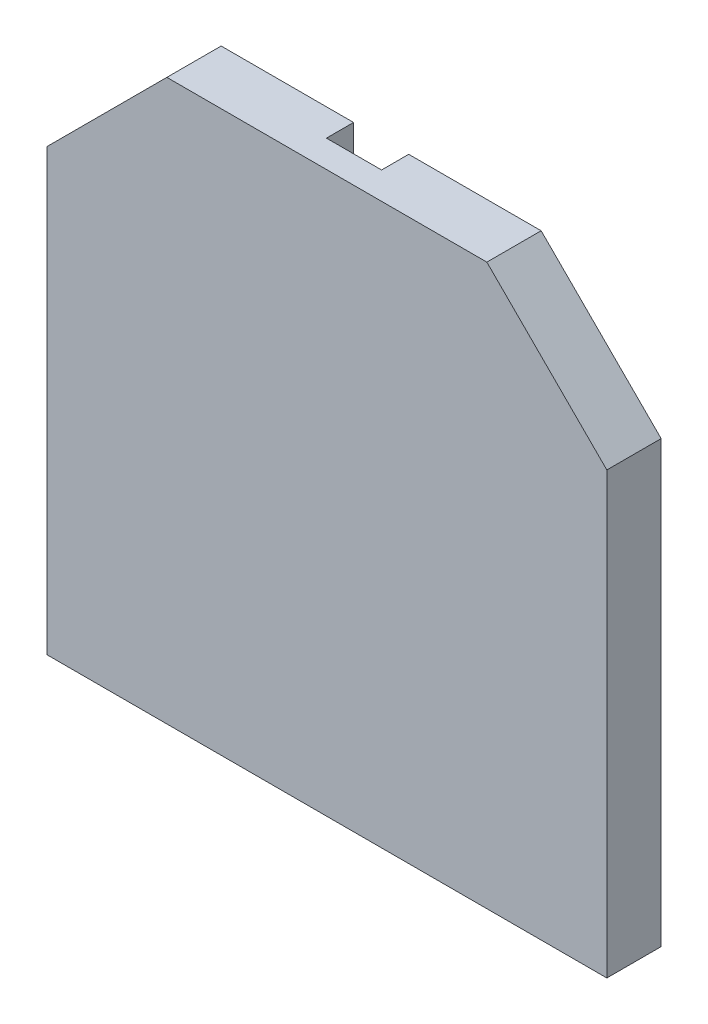
ISO-10303-21;
HEADER;
FILE_DESCRIPTION(('STEP AP214'),'2;1');
FILE_NAME('part.step','',(''),(''),'','','');
FILE_SCHEMA(('AUTOMOTIVE_DESIGN { 1 0 10303 214 1 1 1 1 }'));
ENDSEC;
DATA;
#1=APPLICATION_CONTEXT('core data for automotive mechanical design processes');
#2=APPLICATION_PROTOCOL_DEFINITION('international standard','automotive_design',2000,#1);
#3=PRODUCT_CONTEXT('',#1,'mechanical');
#4=PRODUCT('Part','Part','',(#3));
#5=PRODUCT_RELATED_PRODUCT_CATEGORY('part','',(#4));
#6=PRODUCT_DEFINITION_FORMATION('','',#4);
#7=PRODUCT_DEFINITION_CONTEXT('part definition',#1,'design');
#8=PRODUCT_DEFINITION('design','',#6,#7);
#9=PRODUCT_DEFINITION_SHAPE('','',#8);
#10=(LENGTH_UNIT() NAMED_UNIT(*) SI_UNIT(.MILLI.,.METRE.));
#11=(NAMED_UNIT(*) PLANE_ANGLE_UNIT() SI_UNIT($,.RADIAN.));
#12=(NAMED_UNIT(*) SI_UNIT($,.STERADIAN.) SOLID_ANGLE_UNIT());
#13=UNCERTAINTY_MEASURE_WITH_UNIT(LENGTH_MEASURE(1.E-05),#10,'distance_accuracy_value','');
#14=(GEOMETRIC_REPRESENTATION_CONTEXT(3) GLOBAL_UNCERTAINTY_ASSIGNED_CONTEXT((#13)) GLOBAL_UNIT_ASSIGNED_CONTEXT((#10,
#11,#12)) REPRESENTATION_CONTEXT('',''));
#15=CARTESIAN_POINT('',(0.,0.,0.));
#16=DIRECTION('',(0.,0.,1.));
#17=DIRECTION('',(1.,0.,0.));
#18=AXIS2_PLACEMENT_3D('',#15,#16,#17);
#19=CARTESIAN_POINT('',(-0.32500316,0.68579492,0.31999936));
#20=DIRECTION('',(0.,0.,-1.));
#21=DIRECTION('',(-1.,0.,0.));
#22=AXIS2_PLACEMENT_3D('',#19,#20,#21);
#23=PLANE('',#22);
#24=DIRECTION('',(-1.,0.,0.));
#25=VECTOR('',#24,1.);
#26=CARTESIAN_POINT('',(-0.32500316,0.48579532,0.31999936));
#27=LINE('',#26,#25);
#28=CARTESIAN_POINT('',(-0.32500316,0.48579532,0.31999936));
#29=VERTEX_POINT('',#28);
#30=CARTESIAN_POINT('',(0.32499808,0.48579532,0.31999936));
#31=VERTEX_POINT('',#30);
#32=EDGE_CURVE('E19',#29,#31,#27,.F.);
#33=ORIENTED_EDGE('',*,*,#32,.T.);
#34=DIRECTION('',(0.,1.,0.));
#35=VECTOR('',#34,1.);
#36=CARTESIAN_POINT('',(0.32499808,-1.91420496,0.31999936));
#37=LINE('',#36,#35);
#38=CARTESIAN_POINT('',(0.32499808,-1.91420496,0.31999936));
#39=VERTEX_POINT('',#38);
#40=EDGE_CURVE('E114',#39,#31,#37,.T.);
#41=ORIENTED_EDGE('',*,*,#40,.F.);
#42=DIRECTION('',(1.,0.,0.));
#43=VECTOR('',#42,1.);
#44=CARTESIAN_POINT('',(-0.32500316,-1.91420496,0.31999936));
#45=LINE('',#44,#43);
#46=CARTESIAN_POINT('',(-0.32500316,-1.91420496,0.31999936));
#47=VERTEX_POINT('',#46);
#48=EDGE_CURVE('E131',#47,#39,#45,.T.);
#49=ORIENTED_EDGE('',*,*,#48,.F.);
#50=DIRECTION('',(0.,1.,0.));
#51=VECTOR('',#50,1.);
#52=CARTESIAN_POINT('',(-0.32500316,0.68579492,0.31999936));
#53=LINE('',#52,#51);
#54=EDGE_CURVE('E119',#29,#47,#53,.F.);
#55=ORIENTED_EDGE('',*,*,#54,.F.);
#56=EDGE_LOOP('',(#33,#41,#49,#55));
#57=FACE_BOUND('',#56,.T.);
#58=ADVANCED_FACE('F16',(#57),#23,.T.);
#59=CARTESIAN_POINT('',(-0.32500316,-3.71420136,0.31999936));
#60=DIRECTION('',(0.,0.,-1.));
#61=DIRECTION('',(-1.,0.,0.));
#62=AXIS2_PLACEMENT_3D('',#59,#60,#61);
#63=PLANE('',#62);
#64=DIRECTION('',(-1.,0.,0.));
#65=VECTOR('',#64,1.);
#66=CARTESIAN_POINT('',(-0.32500316,-6.11420164,0.31999936));
#67=LINE('',#66,#65);
#68=CARTESIAN_POINT('',(0.32499808,-6.11420164,0.31999936));
#69=VERTEX_POINT('',#68);
#70=CARTESIAN_POINT('',(-0.32500316,-6.11420164,0.31999936));
#71=VERTEX_POINT('',#70);
#72=EDGE_CURVE('E122',#69,#71,#67,.T.);
#73=ORIENTED_EDGE('',*,*,#72,.T.);
#74=DIRECTION('',(0.,1.,0.));
#75=VECTOR('',#74,1.);
#76=CARTESIAN_POINT('',(-0.32500316,-3.71420136,0.31999936));
#77=LINE('',#76,#75);
#78=CARTESIAN_POINT('',(-0.32500316,-3.71420136,0.31999936));
#79=VERTEX_POINT('',#78);
#80=EDGE_CURVE('E147',#79,#71,#77,.F.);
#81=ORIENTED_EDGE('',*,*,#80,.F.);
#82=DIRECTION('',(1.,0.,0.));
#83=VECTOR('',#82,1.);
#84=CARTESIAN_POINT('',(0.32499808,-3.71420136,0.31999936));
#85=LINE('',#84,#83);
#86=CARTESIAN_POINT('',(0.32499808,-3.71420136,0.31999936));
#87=VERTEX_POINT('',#86);
#88=EDGE_CURVE('E152',#87,#79,#85,.F.);
#89=ORIENTED_EDGE('',*,*,#88,.F.);
#90=DIRECTION('',(0.,1.,0.));
#91=VECTOR('',#90,1.);
#92=CARTESIAN_POINT('',(0.32499808,-6.31420124,0.31999936));
#93=LINE('',#92,#91);
#94=EDGE_CURVE('E164',#69,#87,#93,.T.);
#95=ORIENTED_EDGE('',*,*,#94,.F.);
#96=EDGE_LOOP('',(#73,#81,#89,#95));
#97=FACE_BOUND('',#96,.T.);
#98=ADVANCED_FACE('F250',(#97),#63,.T.);
#99=CARTESIAN_POINT('',(0.32499808,-1.91420496,-1.00000054));
#100=DIRECTION('',(-1.,0.,0.));
#101=DIRECTION('',(0.,0.,1.));
#102=AXIS2_PLACEMENT_3D('',#99,#100,#101);
#103=PLANE('',#102);
#104=DIRECTION('',(0.,0.,1.));
#105=VECTOR('',#104,1.);
#106=CARTESIAN_POINT('',(0.32499808,0.48579532,-1.00000054));
#107=LINE('',#106,#105);
#108=CARTESIAN_POINT('',(0.32499808,0.48579532,0.));
#109=VERTEX_POINT('',#108);
#110=EDGE_CURVE('E124',#31,#109,#107,.F.);
#111=ORIENTED_EDGE('',*,*,#110,.T.);
#112=DIRECTION('',(0.,1.,0.));
#113=VECTOR('',#112,1.);
#114=CARTESIAN_POINT('',(0.32499808,0.48579532,0.));
#115=LINE('',#114,#113);
#116=CARTESIAN_POINT('',(0.32499808,-1.91420496,0.));
#117=VERTEX_POINT('',#116);
#118=EDGE_CURVE('E167',#109,#117,#115,.F.);
#119=ORIENTED_EDGE('',*,*,#118,.T.);
#120=DIRECTION('',(0.,0.,1.));
#121=VECTOR('',#120,1.);
#122=CARTESIAN_POINT('',(0.32499808,-1.91420496,-1.00000054));
#123=LINE('',#122,#121);
#124=EDGE_CURVE('E135',#39,#117,#123,.F.);
#125=ORIENTED_EDGE('',*,*,#124,.F.);
#126=ORIENTED_EDGE('',*,*,#40,.T.);
#127=EDGE_LOOP('',(#111,#119,#125,#126));
#128=FACE_BOUND('',#127,.T.);
#129=ADVANCED_FACE('F133',(#128),#103,.T.);
#130=CARTESIAN_POINT('',(-0.32500316,-1.91420496,-1.00000054));
#131=DIRECTION('',(0.,1.,0.));
#132=DIRECTION('',(0.,0.,1.));
#133=AXIS2_PLACEMENT_3D('',#130,#131,#132);
#134=PLANE('',#133);
#135=ORIENTED_EDGE('',*,*,#124,.T.);
#136=DIRECTION('',(1.,0.,0.));
#137=VECTOR('',#136,1.);
#138=CARTESIAN_POINT('',(-1.88578998,-1.91420496,0.));
#139=LINE('',#138,#137);
#140=CARTESIAN_POINT('',(-0.32500316,-1.91420496,0.));
#141=VERTEX_POINT('',#140);
#142=EDGE_CURVE('E169',#117,#141,#139,.F.);
#143=ORIENTED_EDGE('',*,*,#142,.T.);
#144=DIRECTION('',(0.,0.,-1.));
#145=VECTOR('',#144,1.);
#146=CARTESIAN_POINT('',(-0.32500316,-1.91420496,-1.00000054));
#147=LINE('',#146,#145);
#148=EDGE_CURVE('E141',#47,#141,#147,.T.);
#149=ORIENTED_EDGE('',*,*,#148,.F.);
#150=ORIENTED_EDGE('',*,*,#48,.T.);
#151=EDGE_LOOP('',(#135,#143,#149,#150));
#152=FACE_BOUND('',#151,.T.);
#153=ADVANCED_FACE('F270',(#152),#134,.T.);
#154=CARTESIAN_POINT('',(-0.32500316,0.68579492,-1.00000054));
#155=DIRECTION('',(1.,0.,0.));
#156=DIRECTION('',(0.,0.,-1.));
#157=AXIS2_PLACEMENT_3D('',#154,#155,#156);
#158=PLANE('',#157);
#159=DIRECTION('',(0.,0.,-1.));
#160=VECTOR('',#159,1.);
#161=CARTESIAN_POINT('',(-0.32500316,0.48579532,-1.00000054));
#162=LINE('',#161,#160);
#163=CARTESIAN_POINT('',(-0.32500316,0.48579532,0.));
#164=VERTEX_POINT('',#163);
#165=EDGE_CURVE('E144',#164,#29,#162,.F.);
#166=ORIENTED_EDGE('',*,*,#165,.T.);
#167=ORIENTED_EDGE('',*,*,#54,.T.);
#168=ORIENTED_EDGE('',*,*,#148,.T.);
#169=DIRECTION('',(0.,1.,0.));
#170=VECTOR('',#169,1.);
#171=CARTESIAN_POINT('',(-0.32500316,0.48579532,0.));
#172=LINE('',#171,#170);
#173=EDGE_CURVE('E171',#141,#164,#172,.T.);
#174=ORIENTED_EDGE('',*,*,#173,.T.);
#175=EDGE_LOOP('',(#166,#167,#168,#174));
#176=FACE_BOUND('',#175,.T.);
#177=ADVANCED_FACE('F267',(#176),#158,.T.);
#178=CARTESIAN_POINT('',(-0.32500316,-3.71420136,-1.00000054));
#179=DIRECTION('',(1.,0.,0.));
#180=DIRECTION('',(0.,0.,-1.));
#181=AXIS2_PLACEMENT_3D('',#178,#179,#180);
#182=PLANE('',#181);
#183=DIRECTION('',(0.,0.,-1.));
#184=VECTOR('',#183,1.);
#185=CARTESIAN_POINT('',(-0.32500316,-6.11420164,-1.00000054));
#186=LINE('',#185,#184);
#187=CARTESIAN_POINT('',(-0.32500316,-6.11420164,0.));
#188=VERTEX_POINT('',#187);
#189=EDGE_CURVE('E150',#71,#188,#186,.T.);
#190=ORIENTED_EDGE('',*,*,#189,.T.);
#191=DIRECTION('',(0.,1.,0.));
#192=VECTOR('',#191,1.);
#193=CARTESIAN_POINT('',(-0.32500316,0.48579532,0.));
#194=LINE('',#193,#192);
#195=CARTESIAN_POINT('',(-0.32500316,-3.71420136,0.));
#196=VERTEX_POINT('',#195);
#197=EDGE_CURVE('E174',#188,#196,#194,.T.);
#198=ORIENTED_EDGE('',*,*,#197,.T.);
#199=DIRECTION('',(0.,0.,-1.));
#200=VECTOR('',#199,1.);
#201=CARTESIAN_POINT('',(-0.32500316,-3.71420136,-1.00000054));
#202=LINE('',#201,#200);
#203=EDGE_CURVE('E155',#79,#196,#202,.T.);
#204=ORIENTED_EDGE('',*,*,#203,.F.);
#205=ORIENTED_EDGE('',*,*,#80,.T.);
#206=EDGE_LOOP('',(#190,#198,#204,#205));
#207=FACE_BOUND('',#206,.T.);
#208=ADVANCED_FACE('F244',(#207),#182,.T.);
#209=CARTESIAN_POINT('',(0.32499808,-3.71420136,-1.00000054));
#210=DIRECTION('',(0.,-1.,0.));
#211=DIRECTION('',(0.,0.,-1.));
#212=AXIS2_PLACEMENT_3D('',#209,#210,#211);
#213=PLANE('',#212);
#214=ORIENTED_EDGE('',*,*,#203,.T.);
#215=DIRECTION('',(1.,0.,0.));
#216=VECTOR('',#215,1.);
#217=CARTESIAN_POINT('',(-1.88578998,-3.71420136,0.));
#218=LINE('',#217,#216);
#219=CARTESIAN_POINT('',(0.32499808,-3.71420136,0.));
#220=VERTEX_POINT('',#219);
#221=EDGE_CURVE('E176',#196,#220,#218,.T.);
#222=ORIENTED_EDGE('',*,*,#221,.T.);
#223=DIRECTION('',(0.,0.,1.));
#224=VECTOR('',#223,1.);
#225=CARTESIAN_POINT('',(0.32499808,-3.71420136,-1.00000054));
#226=LINE('',#225,#224);
#227=EDGE_CURVE('E158',#87,#220,#226,.F.);
#228=ORIENTED_EDGE('',*,*,#227,.F.);
#229=ORIENTED_EDGE('',*,*,#88,.T.);
#230=EDGE_LOOP('',(#214,#222,#228,#229));
#231=FACE_BOUND('',#230,.T.);
#232=ADVANCED_FACE('F246',(#231),#213,.T.);
#233=CARTESIAN_POINT('',(0.32499808,-6.31420124,-1.00000054));
#234=DIRECTION('',(-1.,0.,0.));
#235=DIRECTION('',(0.,0.,1.));
#236=AXIS2_PLACEMENT_3D('',#233,#234,#235);
#237=PLANE('',#236);
#238=DIRECTION('',(0.,0.,1.));
#239=VECTOR('',#238,1.);
#240=CARTESIAN_POINT('',(0.32499808,-6.11420164,-1.00000054));
#241=LINE('',#240,#239);
#242=CARTESIAN_POINT('',(0.32499808,-6.11420164,0.));
#243=VERTEX_POINT('',#242);
#244=EDGE_CURVE('E161',#243,#69,#241,.T.);
#245=ORIENTED_EDGE('',*,*,#244,.T.);
#246=ORIENTED_EDGE('',*,*,#94,.T.);
#247=ORIENTED_EDGE('',*,*,#227,.T.);
#248=DIRECTION('',(0.,1.,0.));
#249=VECTOR('',#248,1.);
#250=CARTESIAN_POINT('',(0.32499808,0.48579532,0.));
#251=LINE('',#250,#249);
#252=EDGE_CURVE('E178',#220,#243,#251,.F.);
#253=ORIENTED_EDGE('',*,*,#252,.T.);
#254=EDGE_LOOP('',(#245,#246,#247,#253));
#255=FACE_BOUND('',#254,.T.);
#256=ADVANCED_FACE('F254',(#255),#237,.T.);
#257=CARTESIAN_POINT('',(-1.88578998,0.48579532,0.));
#258=DIRECTION('',(0.,0.,1.));
#259=DIRECTION('',(1.,0.,0.));
#260=AXIS2_PLACEMENT_3D('',#257,#258,#259);
#261=PLANE('',#260);
#262=DIRECTION('',(-0.707106781186548,0.707106781186548,0.));
#263=VECTOR('',#262,1.);
#264=CARTESIAN_POINT('',(1.8857849,0.48579532,0.));
#265=LINE('',#264,#263);
#266=CARTESIAN_POINT('',(3.29999848,-0.92841826,0.));
#267=VERTEX_POINT('',#266);
#268=CARTESIAN_POINT('',(1.8857849,0.48579532,0.));
#269=VERTEX_POINT('',#268);
#270=EDGE_CURVE('E181',#267,#269,#265,.T.);
#271=ORIENTED_EDGE('',*,*,#270,.F.);
#272=DIRECTION('',(0.,1.,0.));
#273=VECTOR('',#272,1.);
#274=CARTESIAN_POINT('',(3.29999848,-0.92841826,0.));
#275=LINE('',#274,#273);
#276=CARTESIAN_POINT('',(3.29999848,-6.11420164,0.));
#277=VERTEX_POINT('',#276);
#278=EDGE_CURVE('E208',#277,#267,#275,.T.);
#279=ORIENTED_EDGE('',*,*,#278,.F.);
#280=DIRECTION('',(1.,0.,0.));
#281=VECTOR('',#280,1.);
#282=CARTESIAN_POINT('',(3.29999848,-6.11420164,0.));
#283=LINE('',#282,#281);
#284=EDGE_CURVE('E205',#243,#277,#283,.T.);
#285=ORIENTED_EDGE('',*,*,#284,.F.);
#286=ORIENTED_EDGE('',*,*,#252,.F.);
#287=ORIENTED_EDGE('',*,*,#221,.F.);
#288=ORIENTED_EDGE('',*,*,#197,.F.);
#289=DIRECTION('',(1.,0.,0.));
#290=VECTOR('',#289,1.);
#291=CARTESIAN_POINT('',(3.29999848,-6.11420164,0.));
#292=LINE('',#291,#290);
#293=CARTESIAN_POINT('',(-3.30000356,-6.11420164,0.));
#294=VERTEX_POINT('',#293);
#295=EDGE_CURVE('E202',#294,#188,#292,.T.);
#296=ORIENTED_EDGE('',*,*,#295,.F.);
#297=DIRECTION('',(0.,1.,0.));
#298=VECTOR('',#297,1.);
#299=CARTESIAN_POINT('',(-3.30000356,-6.11420164,0.));
#300=LINE('',#299,#298);
#301=CARTESIAN_POINT('',(-3.30000356,-0.92841826,0.));
#302=VERTEX_POINT('',#301);
#303=EDGE_CURVE('E197',#302,#294,#300,.F.);
#304=ORIENTED_EDGE('',*,*,#303,.F.);
#305=DIRECTION('',(-0.707106781186548,-0.707106781186548,0.));
#306=VECTOR('',#305,1.);
#307=CARTESIAN_POINT('',(-3.30000356,-0.92841826,0.));
#308=LINE('',#307,#306);
#309=CARTESIAN_POINT('',(-1.88578998,0.48579532,0.));
#310=VERTEX_POINT('',#309);
#311=EDGE_CURVE('E192',#310,#302,#308,.T.);
#312=ORIENTED_EDGE('',*,*,#311,.F.);
#313=DIRECTION('',(1.,0.,0.));
#314=VECTOR('',#313,1.);
#315=CARTESIAN_POINT('',(-1.88578998,0.48579532,0.));
#316=LINE('',#315,#314);
#317=EDGE_CURVE('E185',#164,#310,#316,.F.);
#318=ORIENTED_EDGE('',*,*,#317,.F.);
#319=ORIENTED_EDGE('',*,*,#173,.F.);
#320=ORIENTED_EDGE('',*,*,#142,.F.);
#321=ORIENTED_EDGE('',*,*,#118,.F.);
#322=DIRECTION('',(1.,0.,0.));
#323=VECTOR('',#322,1.);
#324=CARTESIAN_POINT('',(-1.88578998,0.48579532,0.));
#325=LINE('',#324,#323);
#326=EDGE_CURVE('E128',#269,#109,#325,.F.);
#327=ORIENTED_EDGE('',*,*,#326,.F.);
#328=EDGE_LOOP('',(#271,#279,#285,#286,#287,#288,#296,#304,#312,#318,#319,#320,#321,#327));
#329=FACE_BOUND('',#328,.T.);
#330=ADVANCED_FACE('F239',(#329),#261,.F.);
#331=CARTESIAN_POINT('',(1.8857849,0.48579532,0.));
#332=DIRECTION('',(0.707106781186548,0.707106781186548,0.));
#333=DIRECTION('',(-0.707106781186548,0.707106781186548,0.));
#334=AXIS2_PLACEMENT_3D('',#331,#332,#333);
#335=PLANE('',#334);
#336=DIRECTION('',(0.,0.,1.));
#337=VECTOR('',#336,1.);
#338=CARTESIAN_POINT('',(1.8857849,0.48579532,0.));
#339=LINE('',#338,#337);
#340=CARTESIAN_POINT('',(1.8857849,0.48579532,0.64000126));
#341=VERTEX_POINT('',#340);
#342=EDGE_CURVE('E187',#341,#269,#339,.F.);
#343=ORIENTED_EDGE('',*,*,#342,.F.);
#344=DIRECTION('',(-0.707106781186548,0.707106781186547,0.));
#345=VECTOR('',#344,1.);
#346=CARTESIAN_POINT('',(3.29999848,-0.92841826,0.64000126));
#347=LINE('',#346,#345);
#348=CARTESIAN_POINT('',(3.29999848,-0.92841826,0.64000126));
#349=VERTEX_POINT('',#348);
#350=EDGE_CURVE('E214',#349,#341,#347,.T.);
#351=ORIENTED_EDGE('',*,*,#350,.F.);
#352=DIRECTION('',(0.,0.,-1.));
#353=VECTOR('',#352,1.);
#354=CARTESIAN_POINT('',(3.29999848,-0.92841826,0.));
#355=LINE('',#354,#353);
#356=EDGE_CURVE('E211',#267,#349,#355,.F.);
#357=ORIENTED_EDGE('',*,*,#356,.F.);
#358=ORIENTED_EDGE('',*,*,#270,.T.);
#359=EDGE_LOOP('',(#343,#351,#357,#358));
#360=FACE_BOUND('',#359,.T.);
#361=ADVANCED_FACE('F259',(#360),#335,.T.);
#362=CARTESIAN_POINT('',(-1.88578998,0.48579532,0.));
#363=DIRECTION('',(0.,1.,0.));
#364=DIRECTION('',(0.,0.,1.));
#365=AXIS2_PLACEMENT_3D('',#362,#363,#364);
#366=PLANE('',#365);
#367=DIRECTION('',(1.,0.,0.));
#368=VECTOR('',#367,1.);
#369=CARTESIAN_POINT('',(-1.88578998,0.48579532,0.64000126));
#370=LINE('',#369,#368);
#371=CARTESIAN_POINT('',(-1.88578998,0.48579532,0.64000126));
#372=VERTEX_POINT('',#371);
#373=EDGE_CURVE('E217',#341,#372,#370,.F.);
#374=ORIENTED_EDGE('',*,*,#373,.F.);
#375=ORIENTED_EDGE('',*,*,#342,.T.);
#376=ORIENTED_EDGE('',*,*,#326,.T.);
#377=ORIENTED_EDGE('',*,*,#110,.F.);
#378=ORIENTED_EDGE('',*,*,#32,.F.);
#379=ORIENTED_EDGE('',*,*,#165,.F.);
#380=ORIENTED_EDGE('',*,*,#317,.T.);
#381=DIRECTION('',(0.,0.,1.));
#382=VECTOR('',#381,1.);
#383=CARTESIAN_POINT('',(-1.88578998,0.48579532,0.));
#384=LINE('',#383,#382);
#385=EDGE_CURVE('E189',#372,#310,#384,.F.);
#386=ORIENTED_EDGE('',*,*,#385,.F.);
#387=EDGE_LOOP('',(#374,#375,#376,#377,#378,#379,#380,#386));
#388=FACE_BOUND('',#387,.T.);
#389=ADVANCED_FACE('F126',(#388),#366,.T.);
#390=CARTESIAN_POINT('',(-3.30000356,-0.92841826,0.));
#391=DIRECTION('',(-0.707106781186548,0.707106781186548,0.));
#392=DIRECTION('',(-0.707106781186548,-0.707106781186548,0.));
#393=AXIS2_PLACEMENT_3D('',#390,#391,#392);
#394=PLANE('',#393);
#395=DIRECTION('',(0.,0.,1.));
#396=VECTOR('',#395,1.);
#397=CARTESIAN_POINT('',(-3.30000356,-0.92841826,0.));
#398=LINE('',#397,#396);
#399=CARTESIAN_POINT('',(-3.30000356,-0.92841826,0.64000126));
#400=VERTEX_POINT('',#399);
#401=EDGE_CURVE('E194',#400,#302,#398,.F.);
#402=ORIENTED_EDGE('',*,*,#401,.F.);
#403=DIRECTION('',(-0.707106781186548,-0.707106781186547,0.));
#404=VECTOR('',#403,1.);
#405=CARTESIAN_POINT('',(-1.88578998,0.48579532,0.64000126));
#406=LINE('',#405,#404);
#407=EDGE_CURVE('E220',#372,#400,#406,.T.);
#408=ORIENTED_EDGE('',*,*,#407,.F.);
#409=ORIENTED_EDGE('',*,*,#385,.T.);
#410=ORIENTED_EDGE('',*,*,#311,.T.);
#411=EDGE_LOOP('',(#402,#408,#409,#410));
#412=FACE_BOUND('',#411,.T.);
#413=ADVANCED_FACE('F263',(#412),#394,.T.);
#414=CARTESIAN_POINT('',(-3.30000356,-6.11420164,0.));
#415=DIRECTION('',(-1.,0.,0.));
#416=DIRECTION('',(0.,0.,1.));
#417=AXIS2_PLACEMENT_3D('',#414,#415,#416);
#418=PLANE('',#417);
#419=DIRECTION('',(0.,0.,-1.));
#420=VECTOR('',#419,1.);
#421=CARTESIAN_POINT('',(-3.30000356,-6.11420164,0.));
#422=LINE('',#421,#420);
#423=CARTESIAN_POINT('',(-3.30000356,-6.11420164,0.64000126));
#424=VERTEX_POINT('',#423);
#425=EDGE_CURVE('E199',#424,#294,#422,.T.);
#426=ORIENTED_EDGE('',*,*,#425,.F.);
#427=DIRECTION('',(0.,1.,0.));
#428=VECTOR('',#427,1.);
#429=CARTESIAN_POINT('',(-3.30000356,0.48579532,0.64000126));
#430=LINE('',#429,#428);
#431=EDGE_CURVE('E223',#400,#424,#430,.F.);
#432=ORIENTED_EDGE('',*,*,#431,.F.);
#433=ORIENTED_EDGE('',*,*,#401,.T.);
#434=ORIENTED_EDGE('',*,*,#303,.T.);
#435=EDGE_LOOP('',(#426,#432,#433,#434));
#436=FACE_BOUND('',#435,.T.);
#437=ADVANCED_FACE('F234',(#436),#418,.T.);
#438=CARTESIAN_POINT('',(3.29999848,-6.11420164,0.));
#439=DIRECTION('',(0.,-1.,0.));
#440=DIRECTION('',(0.,0.,-1.));
#441=AXIS2_PLACEMENT_3D('',#438,#439,#440);
#442=PLANE('',#441);
#443=ORIENTED_EDGE('',*,*,#284,.T.);
#444=DIRECTION('',(0.,0.,-1.));
#445=VECTOR('',#444,1.);
#446=CARTESIAN_POINT('',(3.29999848,-6.11420164,0.));
#447=LINE('',#446,#445);
#448=CARTESIAN_POINT('',(3.29999848,-6.11420164,0.64000126));
#449=VERTEX_POINT('',#448);
#450=EDGE_CURVE('E34',#449,#277,#447,.T.);
#451=ORIENTED_EDGE('',*,*,#450,.F.);
#452=DIRECTION('',(1.,0.,0.));
#453=VECTOR('',#452,1.);
#454=CARTESIAN_POINT('',(-1.88578998,-6.11420164,0.64000126));
#455=LINE('',#454,#453);
#456=EDGE_CURVE('E25',#424,#449,#455,.T.);
#457=ORIENTED_EDGE('',*,*,#456,.F.);
#458=ORIENTED_EDGE('',*,*,#425,.T.);
#459=ORIENTED_EDGE('',*,*,#295,.T.);
#460=ORIENTED_EDGE('',*,*,#189,.F.);
#461=ORIENTED_EDGE('',*,*,#72,.F.);
#462=ORIENTED_EDGE('',*,*,#244,.F.);
#463=EDGE_LOOP('',(#443,#451,#457,#458,#459,#460,#461,#462));
#464=FACE_BOUND('',#463,.T.);
#465=ADVANCED_FACE('F230',(#464),#442,.T.);
#466=CARTESIAN_POINT('',(3.29999848,-0.92841826,0.));
#467=DIRECTION('',(1.,0.,0.));
#468=DIRECTION('',(0.,0.,-1.));
#469=AXIS2_PLACEMENT_3D('',#466,#467,#468);
#470=PLANE('',#469);
#471=ORIENTED_EDGE('',*,*,#356,.T.);
#472=DIRECTION('',(0.,1.,0.));
#473=VECTOR('',#472,1.);
#474=CARTESIAN_POINT('',(3.29999848,0.48579532,0.64000126));
#475=LINE('',#474,#473);
#476=EDGE_CURVE('E11',#449,#349,#475,.T.);
#477=ORIENTED_EDGE('',*,*,#476,.F.);
#478=ORIENTED_EDGE('',*,*,#450,.T.);
#479=ORIENTED_EDGE('',*,*,#278,.T.);
#480=EDGE_LOOP('',(#471,#477,#478,#479));
#481=FACE_BOUND('',#480,.T.);
#482=ADVANCED_FACE('F257',(#481),#470,.T.);
#483=CARTESIAN_POINT('',(-1.88578998,0.48579532,0.64000126));
#484=DIRECTION('',(0.,0.,1.));
#485=DIRECTION('',(1.,0.,0.));
#486=AXIS2_PLACEMENT_3D('',#483,#484,#485);
#487=PLANE('',#486);
#488=ORIENTED_EDGE('',*,*,#456,.T.);
#489=ORIENTED_EDGE('',*,*,#476,.T.);
#490=ORIENTED_EDGE('',*,*,#350,.T.);
#491=ORIENTED_EDGE('',*,*,#373,.T.);
#492=ORIENTED_EDGE('',*,*,#407,.T.);
#493=ORIENTED_EDGE('',*,*,#431,.T.);
#494=EDGE_LOOP('',(#488,#489,#490,#491,#492,#493));
#495=FACE_BOUND('',#494,.T.);
#496=ADVANCED_FACE('F228',(#495),#487,.T.);
#497=CLOSED_SHELL('',(#58,#98,#129,#153,#177,#208,#232,#256,#330,#361,#389,#413,#437,#465,#482,#496));
#498=MANIFOLD_SOLID_BREP('B1',#497);
#499=ADVANCED_BREP_SHAPE_REPRESENTATION('',(#18,#498),#14);
#500=SHAPE_DEFINITION_REPRESENTATION(#9,#499);
ENDSEC;
END-ISO-10303-21;
